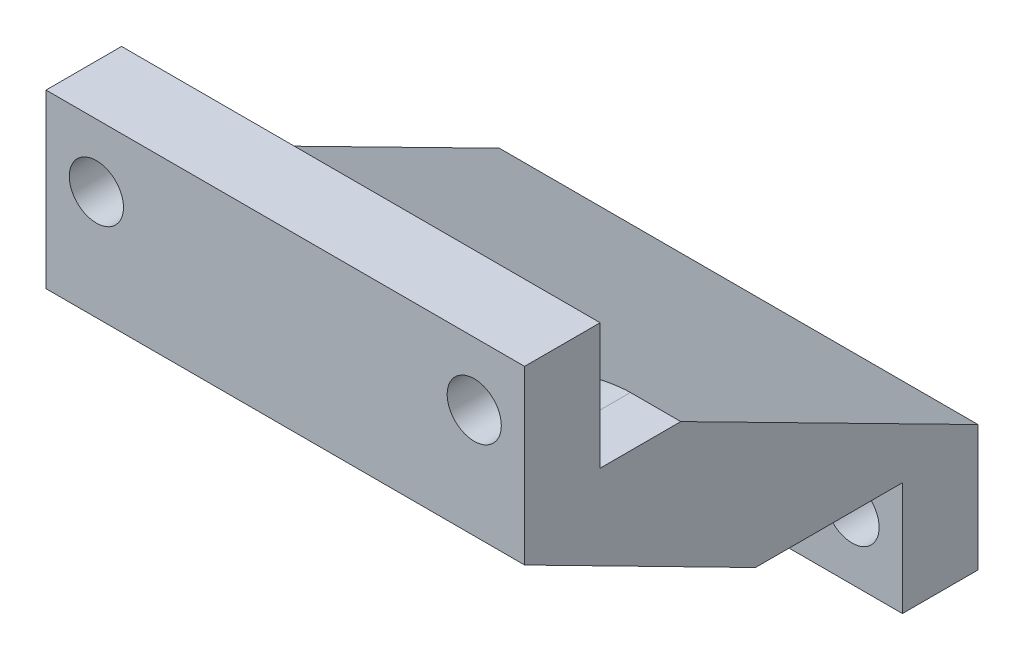
ISO-10303-21;
HEADER;
FILE_DESCRIPTION(('STEP AP214'),'2;1');
FILE_NAME('part.step','',(''),(''),'','','');
FILE_SCHEMA(('AUTOMOTIVE_DESIGN { 1 0 10303 214 1 1 1 1 }'));
ENDSEC;
DATA;
#1=APPLICATION_CONTEXT('core data for automotive mechanical design processes');
#2=APPLICATION_PROTOCOL_DEFINITION('international standard','automotive_design',2000,#1);
#3=PRODUCT_CONTEXT('',#1,'mechanical');
#4=PRODUCT('Part','Part','',(#3));
#5=PRODUCT_RELATED_PRODUCT_CATEGORY('part','',(#4));
#6=PRODUCT_DEFINITION_FORMATION('','',#4);
#7=PRODUCT_DEFINITION_CONTEXT('part definition',#1,'design');
#8=PRODUCT_DEFINITION('design','',#6,#7);
#9=PRODUCT_DEFINITION_SHAPE('','',#8);
#10=(LENGTH_UNIT() NAMED_UNIT(*) SI_UNIT(.MILLI.,.METRE.));
#11=(NAMED_UNIT(*) PLANE_ANGLE_UNIT() SI_UNIT($,.RADIAN.));
#12=(NAMED_UNIT(*) SI_UNIT($,.STERADIAN.) SOLID_ANGLE_UNIT());
#13=UNCERTAINTY_MEASURE_WITH_UNIT(LENGTH_MEASURE(1.E-05),#10,'distance_accuracy_value','');
#14=(GEOMETRIC_REPRESENTATION_CONTEXT(3) GLOBAL_UNCERTAINTY_ASSIGNED_CONTEXT((#13)) GLOBAL_UNIT_ASSIGNED_CONTEXT((#10,
#11,#12)) REPRESENTATION_CONTEXT('',''));
#15=CARTESIAN_POINT('',(0.,0.,0.));
#16=DIRECTION('',(0.,0.,1.));
#17=DIRECTION('',(1.,0.,0.));
#18=AXIS2_PLACEMENT_3D('',#15,#16,#17);
#19=CARTESIAN_POINT('',(84.988658439,-74.005114056,-33.2));
#20=DIRECTION('',(0.,0.,-1.));
#21=DIRECTION('',(0.,-1.,0.));
#22=AXIS2_PLACEMENT_3D('',#19,#20,#21);
#23=CYLINDRICAL_SURFACE('',#22,5.);
#24=DIRECTION('',(0.,0.,-1.));
#25=VECTOR('',#24,1.);
#26=CARTESIAN_POINT('',(84.988658439,-79.005114056,-33.2));
#27=LINE('',#26,#25);
#28=CARTESIAN_POINT('',(84.988658439,-79.005114056,-33.2));
#29=VERTEX_POINT('',#28);
#30=CARTESIAN_POINT('',(84.988658439,-79.005114056,-39.603895088));
#31=VERTEX_POINT('',#30);
#32=EDGE_CURVE('E10',#29,#31,#27,.T.);
#33=ORIENTED_EDGE('',*,*,#32,.F.);
#34=CARTESIAN_POINT('',(84.988658439,-74.005114056,-33.2));
#35=DIRECTION('',(0.,0.,1.));
#36=DIRECTION('',(1.,0.,0.));
#37=AXIS2_PLACEMENT_3D('',#34,#35,#36);
#38=CIRCLE('',#37,5.);
#39=CARTESIAN_POINT('',(89.674925408,-75.7483587,-33.2));
#40=VERTEX_POINT('',#39);
#41=EDGE_CURVE('E346',#29,#40,#38,.T.);
#42=ORIENTED_EDGE('',*,*,#41,.T.);
#43=CARTESIAN_POINT('',(84.988658439,-74.005114056,-29.772184708));
#44=DIRECTION('',(0.,-0.891354901098317,0.45330612205));
#45=DIRECTION('',(0.,-0.45330612205,-0.891354901098317));
#46=AXIS2_PLACEMENT_3D('',#43,#44,#45);
#47=ELLIPSE('',#46,11.030073844,5.);
#48=EDGE_CURVE('E322',#31,#40,#47,.T.);
#49=ORIENTED_EDGE('',*,*,#48,.F.);
#50=EDGE_LOOP('',(#33,#42,#49));
#51=FACE_BOUND('',#50,.T.);
#52=ADVANCED_FACE('F15',(#51),#23,.F.);
#53=CARTESIAN_POINT('',(84.988658439,-79.005114056,-33.2));
#54=DIRECTION('',(0.,1.,0.));
#55=DIRECTION('',(1.,0.,0.));
#56=AXIS2_PLACEMENT_3D('',#53,#54,#55);
#57=PLANE('',#56);
#58=DIRECTION('',(0.,0.,-1.));
#59=VECTOR('',#58,1.);
#60=CARTESIAN_POINT('',(80.988658439,-79.005114056,-33.2));
#61=LINE('',#60,#59);
#62=CARTESIAN_POINT('',(80.988658439,-79.005114056,-33.2));
#63=VERTEX_POINT('',#62);
#64=CARTESIAN_POINT('',(80.988658439,-79.005114056,-39.603895088));
#65=VERTEX_POINT('',#64);
#66=EDGE_CURVE('E456',#63,#65,#61,.T.);
#67=ORIENTED_EDGE('',*,*,#66,.F.);
#68=DIRECTION('',(1.,0.,0.));
#69=VECTOR('',#68,1.);
#70=CARTESIAN_POINT('',(80.988658439,-79.005114056,-33.2));
#71=LINE('',#70,#69);
#72=EDGE_CURVE('E443',#63,#29,#71,.T.);
#73=ORIENTED_EDGE('',*,*,#72,.T.);
#74=ORIENTED_EDGE('',*,*,#32,.T.);
#75=DIRECTION('',(1.,0.,0.));
#76=VECTOR('',#75,1.);
#77=CARTESIAN_POINT('',(80.988658439,-79.005114056,-39.603895088));
#78=LINE('',#77,#76);
#79=EDGE_CURVE('E327',#65,#31,#78,.T.);
#80=ORIENTED_EDGE('',*,*,#79,.F.);
#81=EDGE_LOOP('',(#67,#73,#74,#80));
#82=FACE_BOUND('',#81,.T.);
#83=ADVANCED_FACE('F524',(#82),#57,.T.);
#84=CARTESIAN_POINT('',(114.988658439,-79.005114056,-33.2));
#85=DIRECTION('',(0.,1.,0.));
#86=DIRECTION('',(1.,0.,0.));
#87=AXIS2_PLACEMENT_3D('',#84,#85,#86);
#88=PLANE('',#87);
#89=DIRECTION('',(0.,0.,-1.));
#90=VECTOR('',#89,1.);
#91=CARTESIAN_POINT('',(114.988658439,-79.005114056,-33.2));
#92=LINE('',#91,#90);
#93=CARTESIAN_POINT('',(114.988658439,-79.005114056,-33.2));
#94=VERTEX_POINT('',#93);
#95=CARTESIAN_POINT('',(114.988658439,-79.005114056,-39.603895088));
#96=VERTEX_POINT('',#95);
#97=EDGE_CURVE('E26',#94,#96,#92,.T.);
#98=ORIENTED_EDGE('',*,*,#97,.F.);
#99=DIRECTION('',(1.,0.,0.));
#100=VECTOR('',#99,1.);
#101=CARTESIAN_POINT('',(114.988658439,-79.005114056,-33.2));
#102=LINE('',#101,#100);
#103=CARTESIAN_POINT('',(118.988658439,-79.005114056,-33.2));
#104=VERTEX_POINT('',#103);
#105=EDGE_CURVE('E317',#94,#104,#102,.T.);
#106=ORIENTED_EDGE('',*,*,#105,.T.);
#107=DIRECTION('',(0.,0.,-1.));
#108=VECTOR('',#107,1.);
#109=CARTESIAN_POINT('',(118.988658439,-79.005114056,-33.2));
#110=LINE('',#109,#108);
#111=CARTESIAN_POINT('',(118.988658439,-79.005114056,-39.603895088));
#112=VERTEX_POINT('',#111);
#113=EDGE_CURVE('E298',#104,#112,#110,.T.);
#114=ORIENTED_EDGE('',*,*,#113,.T.);
#115=DIRECTION('',(1.,0.,0.));
#116=VECTOR('',#115,1.);
#117=CARTESIAN_POINT('',(114.988658439,-79.005114056,-39.603895088));
#118=LINE('',#117,#116);
#119=EDGE_CURVE('E303',#96,#112,#118,.T.);
#120=ORIENTED_EDGE('',*,*,#119,.F.);
#121=EDGE_LOOP('',(#98,#106,#114,#120));
#122=FACE_BOUND('',#121,.T.);
#123=ADVANCED_FACE('F530',(#122),#88,.T.);
#124=CARTESIAN_POINT('',(114.988658439,-74.005114056,-33.2));
#125=DIRECTION('',(0.,0.,-1.));
#126=DIRECTION('',(-1.,0.,0.));
#127=AXIS2_PLACEMENT_3D('',#124,#125,#126);
#128=CYLINDRICAL_SURFACE('',#127,5.);
#129=CARTESIAN_POINT('',(114.988658439,-74.005114056,-33.2));
#130=DIRECTION('',(0.,0.,1.));
#131=DIRECTION('',(1.,0.,0.));
#132=AXIS2_PLACEMENT_3D('',#129,#130,#131);
#133=CIRCLE('',#132,5.);
#134=CARTESIAN_POINT('',(110.302391469,-75.7483587,-33.2));
#135=VERTEX_POINT('',#134);
#136=EDGE_CURVE('E312',#135,#94,#133,.T.);
#137=ORIENTED_EDGE('',*,*,#136,.T.);
#138=ORIENTED_EDGE('',*,*,#97,.T.);
#139=CARTESIAN_POINT('',(114.988658439,-74.005114056,-29.772184708));
#140=DIRECTION('',(0.,-0.891354901098317,0.45330612205));
#141=DIRECTION('',(0.,-0.45330612205,-0.891354901098317));
#142=AXIS2_PLACEMENT_3D('',#139,#140,#141);
#143=ELLIPSE('',#142,11.030073844,5.);
#144=EDGE_CURVE('E415',#135,#96,#143,.T.);
#145=ORIENTED_EDGE('',*,*,#144,.F.);
#146=EDGE_LOOP('',(#137,#138,#145));
#147=FACE_BOUND('',#146,.T.);
#148=ADVANCED_FACE('F542',(#147),#128,.F.);
#149=CARTESIAN_POINT('',(110.988658439,-96.005114056,-24.2));
#150=DIRECTION('',(1.,0.,0.));
#151=DIRECTION('',(0.,1.,0.));
#152=AXIS2_PLACEMENT_3D('',#149,#150,#151);
#153=PLANE('',#152);
#154=DIRECTION('',(0.,-1.,0.));
#155=VECTOR('',#154,1.);
#156=CARTESIAN_POINT('',(110.988658439,-96.005114056,-57.2));
#157=LINE('',#156,#155);
#158=CARTESIAN_POINT('',(110.988658439,-96.005114056,-57.2));
#159=VERTEX_POINT('',#158);
#160=CARTESIAN_POINT('',(110.988658439,-97.94844739,-57.2));
#161=VERTEX_POINT('',#160);
#162=EDGE_CURVE('E392',#159,#161,#157,.T.);
#163=ORIENTED_EDGE('',*,*,#162,.F.);
#164=DIRECTION('',(0.,0.,-1.));
#165=VECTOR('',#164,1.);
#166=CARTESIAN_POINT('',(110.988658439,-96.005114056,-53.385387132));
#167=LINE('',#166,#165);
#168=CARTESIAN_POINT('',(110.988658439,-96.005114056,-53.385387132));
#169=VERTEX_POINT('',#168);
#170=EDGE_CURVE('E355',#169,#159,#167,.T.);
#171=ORIENTED_EDGE('',*,*,#170,.F.);
#172=DIRECTION('',(0.,0.453933197028941,0.891035719056809));
#173=VECTOR('',#172,1.);
#174=CARTESIAN_POINT('',(110.988658439,-97.94844739,-57.2));
#175=LINE('',#174,#173);
#176=EDGE_CURVE('E308',#161,#169,#175,.T.);
#177=ORIENTED_EDGE('',*,*,#176,.F.);
#178=EDGE_LOOP('',(#163,#171,#177));
#179=FACE_BOUND('',#178,.T.);
#180=ADVANCED_FACE('F545',(#179),#153,.T.);
#181=CARTESIAN_POINT('',(114.988658439,-96.005114056,-24.2));
#182=DIRECTION('',(0.,0.,-1.));
#183=DIRECTION('',(0.,1.,0.));
#184=AXIS2_PLACEMENT_3D('',#181,#182,#183);
#185=CYLINDRICAL_SURFACE('',#184,4.);
#186=ORIENTED_EDGE('',*,*,#170,.T.);
#187=CARTESIAN_POINT('',(114.988658439,-96.005114056,-57.2));
#188=DIRECTION('',(0.,0.,1.));
#189=DIRECTION('',(0.,-1.,0.));
#190=AXIS2_PLACEMENT_3D('',#187,#188,#189);
#191=CIRCLE('',#190,4.);
#192=CARTESIAN_POINT('',(114.988658439,-92.005114056,-57.2));
#193=VERTEX_POINT('',#192);
#194=EDGE_CURVE('E481',#193,#159,#191,.T.);
#195=ORIENTED_EDGE('',*,*,#194,.F.);
#196=DIRECTION('',(0.,0.,-1.));
#197=VECTOR('',#196,1.);
#198=CARTESIAN_POINT('',(114.988658439,-92.005114056,-45.533696838));
#199=LINE('',#198,#197);
#200=CARTESIAN_POINT('',(114.988658439,-92.005114056,-45.533696838));
#201=VERTEX_POINT('',#200);
#202=EDGE_CURVE('E358',#201,#193,#199,.T.);
#203=ORIENTED_EDGE('',*,*,#202,.F.);
#204=CARTESIAN_POINT('',(114.988658439,-96.005114056,-53.385387132));
#205=DIRECTION('',(0.,0.891035719056809,-0.453933197028941));
#206=DIRECTION('',(0.,-0.453933197028941,-0.891035719056809));
#207=AXIS2_PLACEMENT_3D('',#204,#205,#206);
#208=ELLIPSE('',#207,8.811869295,4.);
#209=EDGE_CURVE('E287',#169,#201,#208,.T.);
#210=ORIENTED_EDGE('',*,*,#209,.F.);
#211=EDGE_LOOP('',(#186,#195,#203,#210));
#212=FACE_BOUND('',#211,.T.);
#213=ADVANCED_FACE('F551',(#212),#185,.F.);
#214=CARTESIAN_POINT('',(114.988658439,-92.005114056,-24.2));
#215=DIRECTION('',(0.,-1.,0.));
#216=DIRECTION('',(0.,0.,-1.));
#217=AXIS2_PLACEMENT_3D('',#214,#215,#216);
#218=PLANE('',#217);
#219=ORIENTED_EDGE('',*,*,#202,.T.);
#220=DIRECTION('',(-1.,0.,0.));
#221=VECTOR('',#220,1.);
#222=CARTESIAN_POINT('',(118.988658439,-92.005114056,-57.2));
#223=LINE('',#222,#221);
#224=CARTESIAN_POINT('',(118.988658439,-92.005114056,-57.2));
#225=VERTEX_POINT('',#224);
#226=EDGE_CURVE('E19',#225,#193,#223,.T.);
#227=ORIENTED_EDGE('',*,*,#226,.F.);
#228=DIRECTION('',(0.,0.,-1.));
#229=VECTOR('',#228,1.);
#230=CARTESIAN_POINT('',(118.988658439,-92.005114056,-45.533696838));
#231=LINE('',#230,#229);
#232=CARTESIAN_POINT('',(118.988658439,-92.005114056,-45.533696838));
#233=VERTEX_POINT('',#232);
#234=EDGE_CURVE('E263',#233,#225,#231,.T.);
#235=ORIENTED_EDGE('',*,*,#234,.F.);
#236=DIRECTION('',(1.,0.,0.));
#237=VECTOR('',#236,1.);
#238=CARTESIAN_POINT('',(114.988658439,-92.005114056,-45.533696838));
#239=LINE('',#238,#237);
#240=EDGE_CURVE('E280',#201,#233,#239,.T.);
#241=ORIENTED_EDGE('',*,*,#240,.F.);
#242=EDGE_LOOP('',(#219,#227,#235,#241));
#243=FACE_BOUND('',#242,.T.);
#244=ADVANCED_FACE('F550',(#243),#218,.T.);
#245=CARTESIAN_POINT('',(84.988658439,-92.005114056,-24.2));
#246=DIRECTION('',(0.,-1.,0.));
#247=DIRECTION('',(0.,0.,-1.));
#248=AXIS2_PLACEMENT_3D('',#245,#246,#247);
#249=PLANE('',#248);
#250=DIRECTION('',(0.,0.,-1.));
#251=VECTOR('',#250,1.);
#252=CARTESIAN_POINT('',(80.988658439,-92.005114056,-45.533696838));
#253=LINE('',#252,#251);
#254=CARTESIAN_POINT('',(80.988658439,-92.005114056,-45.533696838));
#255=VERTEX_POINT('',#254);
#256=CARTESIAN_POINT('',(80.988658439,-92.005114056,-57.2));
#257=VERTEX_POINT('',#256);
#258=EDGE_CURVE('E295',#255,#257,#253,.T.);
#259=ORIENTED_EDGE('',*,*,#258,.T.);
#260=DIRECTION('',(-1.,0.,0.));
#261=VECTOR('',#260,1.);
#262=CARTESIAN_POINT('',(84.988658439,-92.005114056,-57.2));
#263=LINE('',#262,#261);
#264=CARTESIAN_POINT('',(84.988658439,-92.005114056,-57.2));
#265=VERTEX_POINT('',#264);
#266=EDGE_CURVE('E337',#265,#257,#263,.T.);
#267=ORIENTED_EDGE('',*,*,#266,.F.);
#268=DIRECTION('',(0.,0.,-1.));
#269=VECTOR('',#268,1.);
#270=CARTESIAN_POINT('',(84.988658439,-92.005114056,-45.533696838));
#271=LINE('',#270,#269);
#272=CARTESIAN_POINT('',(84.988658439,-92.005114056,-45.533696838));
#273=VERTEX_POINT('',#272);
#274=EDGE_CURVE('E200',#273,#265,#271,.T.);
#275=ORIENTED_EDGE('',*,*,#274,.F.);
#276=DIRECTION('',(1.,0.,0.));
#277=VECTOR('',#276,1.);
#278=CARTESIAN_POINT('',(80.988658439,-92.005114056,-45.533696838));
#279=LINE('',#278,#277);
#280=EDGE_CURVE('E274',#255,#273,#279,.T.);
#281=ORIENTED_EDGE('',*,*,#280,.F.);
#282=EDGE_LOOP('',(#259,#267,#275,#281));
#283=FACE_BOUND('',#282,.T.);
#284=ADVANCED_FACE('F547',(#283),#249,.T.);
#285=CARTESIAN_POINT('',(84.988658439,-96.005114056,-24.2));
#286=DIRECTION('',(0.,0.,-1.));
#287=DIRECTION('',(1.,0.,0.));
#288=AXIS2_PLACEMENT_3D('',#285,#286,#287);
#289=CYLINDRICAL_SURFACE('',#288,4.);
#290=ORIENTED_EDGE('',*,*,#274,.T.);
#291=CARTESIAN_POINT('',(84.988658439,-96.005114056,-57.2));
#292=DIRECTION('',(0.,0.,1.));
#293=DIRECTION('',(-1.,0.,0.));
#294=AXIS2_PLACEMENT_3D('',#291,#292,#293);
#295=CIRCLE('',#294,4.);
#296=CARTESIAN_POINT('',(88.988658439,-96.005114056,-57.2));
#297=VERTEX_POINT('',#296);
#298=EDGE_CURVE('E332',#297,#265,#295,.T.);
#299=ORIENTED_EDGE('',*,*,#298,.F.);
#300=DIRECTION('',(0.,0.,-1.));
#301=VECTOR('',#300,1.);
#302=CARTESIAN_POINT('',(88.988658439,-96.005114056,-53.385387132));
#303=LINE('',#302,#301);
#304=CARTESIAN_POINT('',(88.988658439,-96.005114056,-53.385387132));
#305=VERTEX_POINT('',#304);
#306=EDGE_CURVE('E210',#305,#297,#303,.T.);
#307=ORIENTED_EDGE('',*,*,#306,.F.);
#308=CARTESIAN_POINT('',(84.988658439,-96.005114056,-53.385387132));
#309=DIRECTION('',(0.,0.891035719056809,-0.453933197028941));
#310=DIRECTION('',(0.,-0.453933197028941,-0.891035719056809));
#311=AXIS2_PLACEMENT_3D('',#308,#309,#310);
#312=ELLIPSE('',#311,8.811869295,4.);
#313=EDGE_CURVE('E410',#273,#305,#312,.T.);
#314=ORIENTED_EDGE('',*,*,#313,.F.);
#315=EDGE_LOOP('',(#290,#299,#307,#314));
#316=FACE_BOUND('',#315,.T.);
#317=ADVANCED_FACE('F549',(#316),#289,.F.);
#318=CARTESIAN_POINT('',(88.988658439,-96.005114056,-24.2));
#319=DIRECTION('',(-1.,0.,0.));
#320=DIRECTION('',(0.,0.,1.));
#321=AXIS2_PLACEMENT_3D('',#318,#319,#320);
#322=PLANE('',#321);
#323=ORIENTED_EDGE('',*,*,#306,.T.);
#324=DIRECTION('',(0.,1.,0.));
#325=VECTOR('',#324,1.);
#326=CARTESIAN_POINT('',(88.988658439,-97.94844739,-57.2));
#327=LINE('',#326,#325);
#328=CARTESIAN_POINT('',(88.988658439,-97.94844739,-57.2));
#329=VERTEX_POINT('',#328);
#330=EDGE_CURVE('E328',#329,#297,#327,.T.);
#331=ORIENTED_EDGE('',*,*,#330,.F.);
#332=DIRECTION('',(0.,-0.453933197028941,-0.891035719056809));
#333=VECTOR('',#332,1.);
#334=CARTESIAN_POINT('',(88.988658439,-96.005114056,-53.385387132));
#335=LINE('',#334,#333);
#336=EDGE_CURVE('E309',#305,#329,#335,.T.);
#337=ORIENTED_EDGE('',*,*,#336,.F.);
#338=EDGE_LOOP('',(#323,#331,#337));
#339=FACE_BOUND('',#338,.T.);
#340=ADVANCED_FACE('F535',(#339),#322,.T.);
#341=CARTESIAN_POINT('',(114.988658439,-74.005114056,-13.2));
#342=DIRECTION('',(0.,0.,-1.));
#343=DIRECTION('',(1.,0.,0.));
#344=AXIS2_PLACEMENT_3D('',#341,#342,#343);
#345=CYLINDRICAL_SURFACE('',#344,2.15);
#346=DIRECTION('',(0.,0.,1.));
#347=VECTOR('',#346,1.);
#348=CARTESIAN_POINT('',(117.138658439,-74.005114056,-33.2));
#349=LINE('',#348,#347);
#350=CARTESIAN_POINT('',(117.138658439,-74.005114056,-33.2));
#351=VERTEX_POINT('',#350);
#352=CARTESIAN_POINT('',(117.138658439,-74.005114056,-27.2));
#353=VERTEX_POINT('',#352);
#354=EDGE_CURVE('E349',#351,#353,#349,.T.);
#355=ORIENTED_EDGE('',*,*,#354,.F.);
#356=CARTESIAN_POINT('',(114.988658439,-74.005114056,-33.2));
#357=DIRECTION('',(0.,0.,-1.));
#358=DIRECTION('',(-1.,0.,0.));
#359=AXIS2_PLACEMENT_3D('',#356,#357,#358);
#360=CIRCLE('',#359,2.15);
#361=CARTESIAN_POINT('',(112.838658439,-74.005114056,-33.2));
#362=VERTEX_POINT('',#361);
#363=EDGE_CURVE('E338',#351,#362,#360,.T.);
#364=ORIENTED_EDGE('',*,*,#363,.T.);
#365=CARTESIAN_POINT('',(114.988658439,-74.005114056,-33.2));
#366=DIRECTION('',(0.,0.,-1.));
#367=DIRECTION('',(-1.,0.,0.));
#368=AXIS2_PLACEMENT_3D('',#365,#366,#367);
#369=CIRCLE('',#368,2.15);
#370=EDGE_CURVE('E342',#362,#351,#369,.T.);
#371=ORIENTED_EDGE('',*,*,#370,.T.);
#372=ORIENTED_EDGE('',*,*,#354,.T.);
#373=CARTESIAN_POINT('',(114.988658439,-74.005114056,-27.2));
#374=DIRECTION('',(0.,0.,-1.));
#375=DIRECTION('',(-1.,0.,0.));
#376=AXIS2_PLACEMENT_3D('',#373,#374,#375);
#377=CIRCLE('',#376,2.15);
#378=CARTESIAN_POINT('',(112.838658439,-74.005114056,-27.2));
#379=VERTEX_POINT('',#378);
#380=EDGE_CURVE('E387',#379,#353,#377,.T.);
#381=ORIENTED_EDGE('',*,*,#380,.F.);
#382=CARTESIAN_POINT('',(114.988658439,-74.005114056,-27.2));
#383=DIRECTION('',(0.,0.,-1.));
#384=DIRECTION('',(-1.,0.,0.));
#385=AXIS2_PLACEMENT_3D('',#382,#383,#384);
#386=CIRCLE('',#385,2.15);
#387=EDGE_CURVE('E391',#353,#379,#386,.T.);
#388=ORIENTED_EDGE('',*,*,#387,.F.);
#389=EDGE_LOOP('',(#355,#364,#371,#372,#381,#388));
#390=FACE_BOUND('',#389,.T.);
#391=ADVANCED_FACE('F652',(#390),#345,.F.);
#392=CARTESIAN_POINT('',(84.988658439,-74.005114056,-13.2));
#393=DIRECTION('',(0.,0.,-1.));
#394=DIRECTION('',(1.,0.,0.));
#395=AXIS2_PLACEMENT_3D('',#392,#393,#394);
#396=CYLINDRICAL_SURFACE('',#395,2.15);
#397=DIRECTION('',(0.,0.,1.));
#398=VECTOR('',#397,1.);
#399=CARTESIAN_POINT('',(87.138658439,-74.005114056,-33.2));
#400=LINE('',#399,#398);
#401=CARTESIAN_POINT('',(87.138658439,-74.005114056,-33.2));
#402=VERTEX_POINT('',#401);
#403=CARTESIAN_POINT('',(87.138658439,-74.005114056,-27.2));
#404=VERTEX_POINT('',#403);
#405=EDGE_CURVE('E40',#402,#404,#400,.T.);
#406=ORIENTED_EDGE('',*,*,#405,.F.);
#407=CARTESIAN_POINT('',(84.988658439,-74.005114056,-33.2));
#408=DIRECTION('',(0.,0.,-1.));
#409=DIRECTION('',(-1.,0.,0.));
#410=AXIS2_PLACEMENT_3D('',#407,#408,#409);
#411=CIRCLE('',#410,2.15);
#412=CARTESIAN_POINT('',(82.838658439,-74.005114056,-33.2));
#413=VERTEX_POINT('',#412);
#414=EDGE_CURVE('E316',#402,#413,#411,.T.);
#415=ORIENTED_EDGE('',*,*,#414,.T.);
#416=CARTESIAN_POINT('',(84.988658439,-74.005114056,-33.2));
#417=DIRECTION('',(0.,0.,-1.));
#418=DIRECTION('',(-1.,0.,0.));
#419=AXIS2_PLACEMENT_3D('',#416,#417,#418);
#420=CIRCLE('',#419,2.15);
#421=EDGE_CURVE('E369',#413,#402,#420,.T.);
#422=ORIENTED_EDGE('',*,*,#421,.T.);
#423=ORIENTED_EDGE('',*,*,#405,.T.);
#424=CARTESIAN_POINT('',(84.988658439,-74.005114056,-27.2));
#425=DIRECTION('',(0.,0.,-1.));
#426=DIRECTION('',(-1.,0.,0.));
#427=AXIS2_PLACEMENT_3D('',#424,#425,#426);
#428=CIRCLE('',#427,2.15);
#429=CARTESIAN_POINT('',(82.838658439,-74.005114056,-27.2));
#430=VERTEX_POINT('',#429);
#431=EDGE_CURVE('E321',#430,#404,#428,.T.);
#432=ORIENTED_EDGE('',*,*,#431,.F.);
#433=CARTESIAN_POINT('',(84.988658439,-74.005114056,-27.2));
#434=DIRECTION('',(0.,0.,-1.));
#435=DIRECTION('',(-1.,0.,0.));
#436=AXIS2_PLACEMENT_3D('',#433,#434,#435);
#437=CIRCLE('',#436,2.15);
#438=EDGE_CURVE('E318',#404,#430,#437,.T.);
#439=ORIENTED_EDGE('',*,*,#438,.F.);
#440=EDGE_LOOP('',(#406,#415,#422,#423,#432,#439));
#441=FACE_BOUND('',#440,.T.);
#442=ADVANCED_FACE('F518',(#441),#396,.F.);
#443=CARTESIAN_POINT('',(80.988658439,-78.335114056,-27.2));
#444=DIRECTION('',(0.,0.,1.));
#445=DIRECTION('',(1.,0.,0.));
#446=AXIS2_PLACEMENT_3D('',#443,#444,#445);
#447=PLANE('',#446);
#448=DIRECTION('',(0.,-1.,0.));
#449=VECTOR('',#448,1.);
#450=CARTESIAN_POINT('',(118.988658439,-69.005114056,-27.2));
#451=LINE('',#450,#449);
#452=CARTESIAN_POINT('',(118.988658439,-69.005114056,-27.2));
#453=VERTEX_POINT('',#452);
#454=CARTESIAN_POINT('',(118.988658439,-82.665114056,-27.2));
#455=VERTEX_POINT('',#454);
#456=EDGE_CURVE('E251',#453,#455,#451,.T.);
#457=ORIENTED_EDGE('',*,*,#456,.F.);
#458=DIRECTION('',(1.,0.,0.));
#459=VECTOR('',#458,1.);
#460=CARTESIAN_POINT('',(80.988658439,-69.005114056,-27.2));
#461=LINE('',#460,#459);
#462=CARTESIAN_POINT('',(80.988658439,-69.005114056,-27.2));
#463=VERTEX_POINT('',#462);
#464=EDGE_CURVE('E219',#463,#453,#461,.T.);
#465=ORIENTED_EDGE('',*,*,#464,.F.);
#466=DIRECTION('',(0.,-1.,0.));
#467=VECTOR('',#466,1.);
#468=CARTESIAN_POINT('',(80.988658439,-69.005114056,-27.2));
#469=LINE('',#468,#467);
#470=CARTESIAN_POINT('',(80.988658439,-82.665114056,-27.2));
#471=VERTEX_POINT('',#470);
#472=EDGE_CURVE('E269',#463,#471,#469,.T.);
#473=ORIENTED_EDGE('',*,*,#472,.T.);
#474=DIRECTION('',(1.,0.,0.));
#475=VECTOR('',#474,1.);
#476=CARTESIAN_POINT('',(80.988658439,-82.665114056,-27.2));
#477=LINE('',#476,#475);
#478=EDGE_CURVE('E265',#471,#455,#477,.T.);
#479=ORIENTED_EDGE('',*,*,#478,.T.);
#480=EDGE_LOOP('',(#457,#465,#473,#479));
#481=FACE_BOUND('',#480,.T.);
#482=ORIENTED_EDGE('',*,*,#431,.T.);
#483=ORIENTED_EDGE('',*,*,#438,.T.);
#484=EDGE_LOOP('',(#482,#483));
#485=FACE_BOUND('',#484,.T.);
#486=ORIENTED_EDGE('',*,*,#380,.T.);
#487=ORIENTED_EDGE('',*,*,#387,.T.);
#488=EDGE_LOOP('',(#486,#487));
#489=FACE_BOUND('',#488,.T.);
#490=ADVANCED_FACE('F266',(#481,#485,#489),#447,.T.);
#491=CARTESIAN_POINT('',(80.988658439,-99.476780723,-57.2));
#492=DIRECTION('',(0.,0.,-1.));
#493=DIRECTION('',(0.,-1.,0.));
#494=AXIS2_PLACEMENT_3D('',#491,#492,#493);
#495=PLANE('',#494);
#496=CARTESIAN_POINT('',(84.988658439,-96.005114056,-57.2));
#497=DIRECTION('',(0.,0.,1.));
#498=DIRECTION('',(1.,0.,0.));
#499=AXIS2_PLACEMENT_3D('',#496,#497,#498);
#500=CIRCLE('',#499,2.15);
#501=CARTESIAN_POINT('',(87.138658439,-96.005114056,-57.2));
#502=VERTEX_POINT('',#501);
#503=EDGE_CURVE('E353',#502,#502,#500,.T.);
#504=ORIENTED_EDGE('',*,*,#503,.F.);
#505=EDGE_LOOP('',(#504));
#506=FACE_BOUND('',#505,.T.);
#507=DIRECTION('',(1.,0.,0.));
#508=VECTOR('',#507,1.);
#509=CARTESIAN_POINT('',(88.988658439,-97.94844739,-57.2));
#510=LINE('',#509,#508);
#511=EDGE_CURVE('E304',#329,#161,#510,.T.);
#512=ORIENTED_EDGE('',*,*,#511,.F.);
#513=ORIENTED_EDGE('',*,*,#330,.T.);
#514=ORIENTED_EDGE('',*,*,#298,.T.);
#515=ORIENTED_EDGE('',*,*,#266,.T.);
#516=DIRECTION('',(0.,1.,0.));
#517=VECTOR('',#516,1.);
#518=CARTESIAN_POINT('',(80.988658439,-101.005114056,-57.2));
#519=LINE('',#518,#517);
#520=CARTESIAN_POINT('',(80.988658439,-101.005114056,-57.2));
#521=VERTEX_POINT('',#520);
#522=EDGE_CURVE('E427',#521,#257,#519,.T.);
#523=ORIENTED_EDGE('',*,*,#522,.F.);
#524=DIRECTION('',(1.,0.,0.));
#525=VECTOR('',#524,1.);
#526=CARTESIAN_POINT('',(80.988658439,-101.005114056,-57.2));
#527=LINE('',#526,#525);
#528=CARTESIAN_POINT('',(118.988658439,-101.005114056,-57.2));
#529=VERTEX_POINT('',#528);
#530=EDGE_CURVE('E333',#521,#529,#527,.T.);
#531=ORIENTED_EDGE('',*,*,#530,.T.);
#532=DIRECTION('',(0.,1.,0.));
#533=VECTOR('',#532,1.);
#534=CARTESIAN_POINT('',(118.988658439,-101.005114056,-57.2));
#535=LINE('',#534,#533);
#536=EDGE_CURVE('E403',#529,#225,#535,.T.);
#537=ORIENTED_EDGE('',*,*,#536,.T.);
#538=ORIENTED_EDGE('',*,*,#226,.T.);
#539=ORIENTED_EDGE('',*,*,#194,.T.);
#540=ORIENTED_EDGE('',*,*,#162,.T.);
#541=EDGE_LOOP('',(#512,#513,#514,#515,#523,#531,#537,#538,#539,#540));
#542=FACE_BOUND('',#541,.T.);
#543=CARTESIAN_POINT('',(114.988658439,-96.005114056,-57.2));
#544=DIRECTION('',(0.,0.,1.));
#545=DIRECTION('',(1.,0.,0.));
#546=AXIS2_PLACEMENT_3D('',#543,#544,#545);
#547=CIRCLE('',#546,2.15);
#548=CARTESIAN_POINT('',(117.138658439,-96.005114056,-57.2));
#549=VERTEX_POINT('',#548);
#550=EDGE_CURVE('E362',#549,#549,#547,.T.);
#551=ORIENTED_EDGE('',*,*,#550,.F.);
#552=EDGE_LOOP('',(#551));
#553=FACE_BOUND('',#552,.T.);
#554=ADVANCED_FACE('F505',(#506,#542,#553),#495,.F.);
#555=CARTESIAN_POINT('',(80.988658439,-101.005114056,-60.2));
#556=DIRECTION('',(0.,1.,0.));
#557=DIRECTION('',(1.,0.,0.));
#558=AXIS2_PLACEMENT_3D('',#555,#556,#557);
#559=PLANE('',#558);
#560=DIRECTION('',(0.,0.,1.));
#561=VECTOR('',#560,1.);
#562=CARTESIAN_POINT('',(118.988658439,-101.005114056,-63.2));
#563=LINE('',#562,#561);
#564=CARTESIAN_POINT('',(118.988658439,-101.005114056,-63.2));
#565=VERTEX_POINT('',#564);
#566=EDGE_CURVE('E398',#565,#529,#563,.T.);
#567=ORIENTED_EDGE('',*,*,#566,.T.);
#568=ORIENTED_EDGE('',*,*,#530,.F.);
#569=DIRECTION('',(0.,0.,1.));
#570=VECTOR('',#569,1.);
#571=CARTESIAN_POINT('',(80.988658439,-101.005114056,-63.2));
#572=LINE('',#571,#570);
#573=CARTESIAN_POINT('',(80.988658439,-101.005114056,-63.2));
#574=VERTEX_POINT('',#573);
#575=EDGE_CURVE('E463',#574,#521,#572,.T.);
#576=ORIENTED_EDGE('',*,*,#575,.F.);
#577=DIRECTION('',(1.,0.,0.));
#578=VECTOR('',#577,1.);
#579=CARTESIAN_POINT('',(80.988658439,-101.005114056,-63.2));
#580=LINE('',#579,#578);
#581=EDGE_CURVE('E371',#574,#565,#580,.T.);
#582=ORIENTED_EDGE('',*,*,#581,.T.);
#583=EDGE_LOOP('',(#567,#568,#576,#582));
#584=FACE_BOUND('',#583,.T.);
#585=ADVANCED_FACE('F507',(#584),#559,.F.);
#586=CARTESIAN_POINT('',(80.988658439,-93.505114056,-63.2));
#587=DIRECTION('',(0.,0.,-1.));
#588=DIRECTION('',(0.,-1.,0.));
#589=AXIS2_PLACEMENT_3D('',#586,#587,#588);
#590=PLANE('',#589);
#591=DIRECTION('',(0.,1.,0.));
#592=VECTOR('',#591,1.);
#593=CARTESIAN_POINT('',(118.988658439,-101.005114056,-63.2));
#594=LINE('',#593,#592);
#595=CARTESIAN_POINT('',(118.988658439,-91.005114056,-63.2));
#596=VERTEX_POINT('',#595);
#597=EDGE_CURVE('E402',#565,#596,#594,.T.);
#598=ORIENTED_EDGE('',*,*,#597,.F.);
#599=ORIENTED_EDGE('',*,*,#581,.F.);
#600=DIRECTION('',(0.,1.,0.));
#601=VECTOR('',#600,1.);
#602=CARTESIAN_POINT('',(80.988658439,-101.005114056,-63.2));
#603=LINE('',#602,#601);
#604=CARTESIAN_POINT('',(80.988658439,-91.005114056,-63.2));
#605=VERTEX_POINT('',#604);
#606=EDGE_CURVE('E470',#574,#605,#603,.T.);
#607=ORIENTED_EDGE('',*,*,#606,.T.);
#608=DIRECTION('',(1.,0.,0.));
#609=VECTOR('',#608,1.);
#610=CARTESIAN_POINT('',(80.988658439,-91.005114056,-63.2));
#611=LINE('',#610,#609);
#612=EDGE_CURVE('E291',#605,#596,#611,.T.);
#613=ORIENTED_EDGE('',*,*,#612,.T.);
#614=EDGE_LOOP('',(#598,#599,#607,#613));
#615=FACE_BOUND('',#614,.T.);
#616=CARTESIAN_POINT('',(114.988658439,-96.005114056,-63.2));
#617=DIRECTION('',(0.,0.,1.));
#618=DIRECTION('',(-1.,0.,0.));
#619=AXIS2_PLACEMENT_3D('',#616,#617,#618);
#620=CIRCLE('',#619,2.15);
#621=CARTESIAN_POINT('',(112.838658439,-96.005114056,-63.2));
#622=VERTEX_POINT('',#621);
#623=CARTESIAN_POINT('',(117.138658439,-96.005114056,-63.2));
#624=VERTEX_POINT('',#623);
#625=EDGE_CURVE('E363',#622,#624,#620,.T.);
#626=ORIENTED_EDGE('',*,*,#625,.T.);
#627=CARTESIAN_POINT('',(114.988658439,-96.005114056,-63.2));
#628=DIRECTION('',(0.,0.,1.));
#629=DIRECTION('',(-1.,0.,0.));
#630=AXIS2_PLACEMENT_3D('',#627,#628,#629);
#631=CIRCLE('',#630,2.15);
#632=EDGE_CURVE('E359',#624,#622,#631,.T.);
#633=ORIENTED_EDGE('',*,*,#632,.T.);
#634=EDGE_LOOP('',(#626,#633));
#635=FACE_BOUND('',#634,.T.);
#636=CARTESIAN_POINT('',(84.988658439,-96.005114056,-63.2));
#637=DIRECTION('',(0.,0.,1.));
#638=DIRECTION('',(-1.,0.,0.));
#639=AXIS2_PLACEMENT_3D('',#636,#637,#638);
#640=CIRCLE('',#639,2.15);
#641=CARTESIAN_POINT('',(82.838658439,-96.005114056,-63.2));
#642=VERTEX_POINT('',#641);
#643=CARTESIAN_POINT('',(87.138658439,-96.005114056,-63.2));
#644=VERTEX_POINT('',#643);
#645=EDGE_CURVE('E354',#642,#644,#640,.T.);
#646=ORIENTED_EDGE('',*,*,#645,.T.);
#647=CARTESIAN_POINT('',(84.988658439,-96.005114056,-63.2));
#648=DIRECTION('',(0.,0.,1.));
#649=DIRECTION('',(-1.,0.,0.));
#650=AXIS2_PLACEMENT_3D('',#647,#648,#649);
#651=CIRCLE('',#650,2.15);
#652=EDGE_CURVE('E350',#644,#642,#651,.T.);
#653=ORIENTED_EDGE('',*,*,#652,.T.);
#654=EDGE_LOOP('',(#646,#653));
#655=FACE_BOUND('',#654,.T.);
#656=ADVANCED_FACE('F515',(#615,#635,#655),#590,.T.);
#657=CARTESIAN_POINT('',(80.988658439,-72.376736378,-33.2));
#658=DIRECTION('',(0.,0.,1.));
#659=DIRECTION('',(1.,0.,0.));
#660=AXIS2_PLACEMENT_3D('',#657,#658,#659);
#661=PLANE('',#660);
#662=ORIENTED_EDGE('',*,*,#414,.F.);
#663=ORIENTED_EDGE('',*,*,#421,.F.);
#664=EDGE_LOOP('',(#662,#663));
#665=FACE_BOUND('',#664,.T.);
#666=DIRECTION('',(1.,0.,0.));
#667=VECTOR('',#666,1.);
#668=CARTESIAN_POINT('',(89.674925408,-75.7483587,-33.2));
#669=LINE('',#668,#667);
#670=EDGE_CURVE('E326',#40,#135,#669,.T.);
#671=ORIENTED_EDGE('',*,*,#670,.F.);
#672=ORIENTED_EDGE('',*,*,#41,.F.);
#673=ORIENTED_EDGE('',*,*,#72,.F.);
#674=DIRECTION('',(0.,-1.,0.));
#675=VECTOR('',#674,1.);
#676=CARTESIAN_POINT('',(80.988658439,-69.005114056,-33.2));
#677=LINE('',#676,#675);
#678=CARTESIAN_POINT('',(80.988658439,-69.005114056,-33.2));
#679=VERTEX_POINT('',#678);
#680=EDGE_CURVE('E452',#679,#63,#677,.T.);
#681=ORIENTED_EDGE('',*,*,#680,.F.);
#682=DIRECTION('',(1.,0.,0.));
#683=VECTOR('',#682,1.);
#684=CARTESIAN_POINT('',(80.988658439,-69.005114056,-33.2));
#685=LINE('',#684,#683);
#686=CARTESIAN_POINT('',(118.988658439,-69.005114056,-33.2));
#687=VERTEX_POINT('',#686);
#688=EDGE_CURVE('E407',#679,#687,#685,.T.);
#689=ORIENTED_EDGE('',*,*,#688,.T.);
#690=DIRECTION('',(0.,-1.,0.));
#691=VECTOR('',#690,1.);
#692=CARTESIAN_POINT('',(118.988658439,-69.005114056,-33.2));
#693=LINE('',#692,#691);
#694=EDGE_CURVE('E406',#687,#104,#693,.T.);
#695=ORIENTED_EDGE('',*,*,#694,.T.);
#696=ORIENTED_EDGE('',*,*,#105,.F.);
#697=ORIENTED_EDGE('',*,*,#136,.F.);
#698=EDGE_LOOP('',(#671,#672,#673,#681,#689,#695,#696,#697));
#699=FACE_BOUND('',#698,.T.);
#700=ORIENTED_EDGE('',*,*,#363,.F.);
#701=ORIENTED_EDGE('',*,*,#370,.F.);
#702=EDGE_LOOP('',(#700,#701));
#703=FACE_BOUND('',#702,.T.);
#704=ADVANCED_FACE('F605',(#665,#699,#703),#661,.F.);
#705=CARTESIAN_POINT('',(80.988658439,-69.005114056,-30.2));
#706=DIRECTION('',(0.,-1.,0.));
#707=DIRECTION('',(0.,0.,-1.));
#708=AXIS2_PLACEMENT_3D('',#705,#706,#707);
#709=PLANE('',#708);
#710=DIRECTION('',(0.,0.,-1.));
#711=VECTOR('',#710,1.);
#712=CARTESIAN_POINT('',(118.988658439,-69.005114056,-27.2));
#713=LINE('',#712,#711);
#714=EDGE_CURVE('E261',#453,#687,#713,.T.);
#715=ORIENTED_EDGE('',*,*,#714,.T.);
#716=ORIENTED_EDGE('',*,*,#688,.F.);
#717=DIRECTION('',(0.,0.,-1.));
#718=VECTOR('',#717,1.);
#719=CARTESIAN_POINT('',(80.988658439,-69.005114056,-27.2));
#720=LINE('',#719,#718);
#721=EDGE_CURVE('E368',#463,#679,#720,.T.);
#722=ORIENTED_EDGE('',*,*,#721,.F.);
#723=ORIENTED_EDGE('',*,*,#464,.T.);
#724=EDGE_LOOP('',(#715,#716,#722,#723));
#725=FACE_BOUND('',#724,.T.);
#726=ADVANCED_FACE('F540',(#725),#709,.F.);
#727=CARTESIAN_POINT('',(84.988658439,-96.005114056,-34.2));
#728=DIRECTION('',(0.,0.,-1.));
#729=DIRECTION('',(1.,0.,0.));
#730=AXIS2_PLACEMENT_3D('',#727,#728,#729);
#731=CYLINDRICAL_SURFACE('',#730,2.15);
#732=DIRECTION('',(0.,0.,1.));
#733=VECTOR('',#732,1.);
#734=CARTESIAN_POINT('',(87.138658439,-96.005114056,-63.2));
#735=LINE('',#734,#733);
#736=EDGE_CURVE('E451',#644,#502,#735,.T.);
#737=ORIENTED_EDGE('',*,*,#736,.F.);
#738=ORIENTED_EDGE('',*,*,#645,.F.);
#739=ORIENTED_EDGE('',*,*,#652,.F.);
#740=ORIENTED_EDGE('',*,*,#736,.T.);
#741=ORIENTED_EDGE('',*,*,#503,.T.);
#742=EDGE_LOOP('',(#737,#738,#739,#740,#741));
#743=FACE_BOUND('',#742,.T.);
#744=ADVANCED_FACE('F537',(#743),#731,.F.);
#745=CARTESIAN_POINT('',(114.988658439,-96.005114056,-34.2));
#746=DIRECTION('',(0.,0.,-1.));
#747=DIRECTION('',(1.,0.,0.));
#748=AXIS2_PLACEMENT_3D('',#745,#746,#747);
#749=CYLINDRICAL_SURFACE('',#748,2.15);
#750=DIRECTION('',(0.,0.,1.));
#751=VECTOR('',#750,1.);
#752=CARTESIAN_POINT('',(117.138658439,-96.005114056,-63.2));
#753=LINE('',#752,#751);
#754=EDGE_CURVE('E447',#624,#549,#753,.T.);
#755=ORIENTED_EDGE('',*,*,#754,.F.);
#756=ORIENTED_EDGE('',*,*,#625,.F.);
#757=ORIENTED_EDGE('',*,*,#632,.F.);
#758=ORIENTED_EDGE('',*,*,#754,.T.);
#759=ORIENTED_EDGE('',*,*,#550,.T.);
#760=EDGE_LOOP('',(#755,#756,#757,#758,#759));
#761=FACE_BOUND('',#760,.T.);
#762=ADVANCED_FACE('F17',(#761),#749,.F.);
#763=CARTESIAN_POINT('',(118.988658439,190.994885944,247.8));
#764=DIRECTION('',(-1.,0.,0.));
#765=DIRECTION('',(0.,0.,1.));
#766=AXIS2_PLACEMENT_3D('',#763,#764,#765);
#767=PLANE('',#766);
#768=ORIENTED_EDGE('',*,*,#113,.F.);
#769=ORIENTED_EDGE('',*,*,#694,.F.);
#770=ORIENTED_EDGE('',*,*,#714,.F.);
#771=ORIENTED_EDGE('',*,*,#456,.T.);
#772=DIRECTION('',(0.,-0.453933197028941,-0.891035719056809));
#773=VECTOR('',#772,1.);
#774=CARTESIAN_POINT('',(118.988658439,-82.665114056,-27.2));
#775=LINE('',#774,#773);
#776=EDGE_CURVE('E257',#455,#233,#775,.T.);
#777=ORIENTED_EDGE('',*,*,#776,.T.);
#778=ORIENTED_EDGE('',*,*,#234,.T.);
#779=ORIENTED_EDGE('',*,*,#536,.F.);
#780=ORIENTED_EDGE('',*,*,#566,.F.);
#781=ORIENTED_EDGE('',*,*,#597,.T.);
#782=DIRECTION('',(0.,0.45330612205,0.891354901098317));
#783=VECTOR('',#782,1.);
#784=CARTESIAN_POINT('',(118.988658439,-91.005114056,-63.2));
#785=LINE('',#784,#783);
#786=EDGE_CURVE('E299',#596,#112,#785,.T.);
#787=ORIENTED_EDGE('',*,*,#786,.T.);
#788=EDGE_LOOP('',(#768,#769,#770,#771,#777,#778,#779,#780,#781,#787));
#789=FACE_BOUND('',#788,.T.);
#790=ADVANCED_FACE('F254',(#789),#767,.F.);
#791=CARTESIAN_POINT('',(80.988658439,-91.835114056,-45.2));
#792=DIRECTION('',(0.,-0.891035719056809,0.453933197028941));
#793=DIRECTION('',(-1.,0.,0.));
#794=AXIS2_PLACEMENT_3D('',#791,#792,#793);
#795=PLANE('',#794);
#796=ORIENTED_EDGE('',*,*,#313,.T.);
#797=ORIENTED_EDGE('',*,*,#336,.T.);
#798=ORIENTED_EDGE('',*,*,#511,.T.);
#799=ORIENTED_EDGE('',*,*,#176,.T.);
#800=ORIENTED_EDGE('',*,*,#209,.T.);
#801=ORIENTED_EDGE('',*,*,#240,.T.);
#802=ORIENTED_EDGE('',*,*,#776,.F.);
#803=ORIENTED_EDGE('',*,*,#478,.F.);
#804=DIRECTION('',(0.,-0.453933197028941,-0.891035719056809));
#805=VECTOR('',#804,1.);
#806=CARTESIAN_POINT('',(80.988658439,-82.665114056,-27.2));
#807=LINE('',#806,#805);
#808=EDGE_CURVE('E293',#471,#255,#807,.T.);
#809=ORIENTED_EDGE('',*,*,#808,.T.);
#810=ORIENTED_EDGE('',*,*,#280,.T.);
#811=EDGE_LOOP('',(#796,#797,#798,#799,#800,#801,#802,#803,#809,#810));
#812=FACE_BOUND('',#811,.T.);
#813=ADVANCED_FACE('F277',(#812),#795,.T.);
#814=CARTESIAN_POINT('',(80.988658439,190.994885944,247.8));
#815=DIRECTION('',(-1.,0.,0.));
#816=DIRECTION('',(0.,0.,1.));
#817=AXIS2_PLACEMENT_3D('',#814,#815,#816);
#818=PLANE('',#817);
#819=ORIENTED_EDGE('',*,*,#680,.T.);
#820=ORIENTED_EDGE('',*,*,#66,.T.);
#821=DIRECTION('',(0.,0.45330612205,0.891354901098317));
#822=VECTOR('',#821,1.);
#823=CARTESIAN_POINT('',(80.988658439,-91.005114056,-63.2));
#824=LINE('',#823,#822);
#825=EDGE_CURVE('E440',#605,#65,#824,.T.);
#826=ORIENTED_EDGE('',*,*,#825,.F.);
#827=ORIENTED_EDGE('',*,*,#606,.F.);
#828=ORIENTED_EDGE('',*,*,#575,.T.);
#829=ORIENTED_EDGE('',*,*,#522,.T.);
#830=ORIENTED_EDGE('',*,*,#258,.F.);
#831=ORIENTED_EDGE('',*,*,#808,.F.);
#832=ORIENTED_EDGE('',*,*,#472,.F.);
#833=ORIENTED_EDGE('',*,*,#721,.T.);
#834=EDGE_LOOP('',(#819,#820,#826,#827,#828,#829,#830,#831,#832,#833));
#835=FACE_BOUND('',#834,.T.);
#836=ADVANCED_FACE('F597',(#835),#818,.T.);
#837=CARTESIAN_POINT('',(80.988658439,-83.376736378,-48.2));
#838=DIRECTION('',(0.,0.891354901098317,-0.45330612205));
#839=DIRECTION('',(-1.,0.,0.));
#840=AXIS2_PLACEMENT_3D('',#837,#838,#839);
#841=PLANE('',#840);
#842=ORIENTED_EDGE('',*,*,#825,.T.);
#843=ORIENTED_EDGE('',*,*,#79,.T.);
#844=ORIENTED_EDGE('',*,*,#48,.T.);
#845=ORIENTED_EDGE('',*,*,#670,.T.);
#846=ORIENTED_EDGE('',*,*,#144,.T.);
#847=ORIENTED_EDGE('',*,*,#119,.T.);
#848=ORIENTED_EDGE('',*,*,#786,.F.);
#849=ORIENTED_EDGE('',*,*,#612,.F.);
#850=EDGE_LOOP('',(#842,#843,#844,#845,#846,#847,#848,#849));
#851=FACE_BOUND('',#850,.T.);
#852=ADVANCED_FACE('F596',(#851),#841,.T.);
#853=CLOSED_SHELL('',(#52,#83,#123,#148,#180,#213,#244,#284,#317,#340,#391,#442,#490,#554,#585,
#656,#704,#726,#744,#762,#790,#813,#836,#852));
#854=MANIFOLD_SOLID_BREP('B1',#853);
#855=ADVANCED_BREP_SHAPE_REPRESENTATION('',(#18,#854),#14);
#856=SHAPE_DEFINITION_REPRESENTATION(#9,#855);
ENDSEC;
END-ISO-10303-21;
